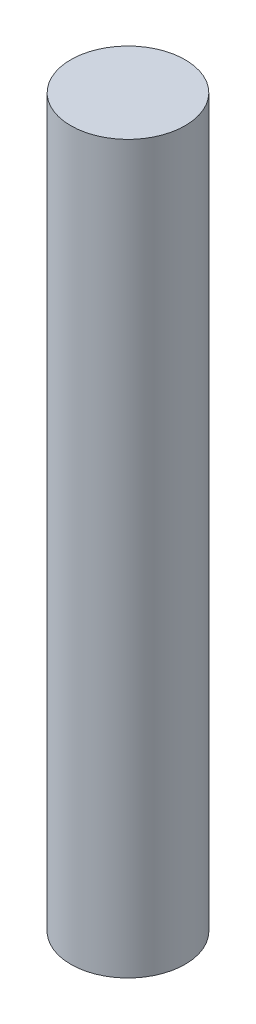
ISO-10303-21;
HEADER;
FILE_DESCRIPTION(('STEP AP214'),'2;1');
FILE_NAME('part.step','',(''),(''),'','','');
FILE_SCHEMA(('AUTOMOTIVE_DESIGN { 1 0 10303 214 1 1 1 1 }'));
ENDSEC;
DATA;
#1=APPLICATION_CONTEXT('core data for automotive mechanical design processes');
#2=APPLICATION_PROTOCOL_DEFINITION('international standard','automotive_design',2000,#1);
#3=PRODUCT_CONTEXT('',#1,'mechanical');
#4=PRODUCT('Part','Part','',(#3));
#5=PRODUCT_RELATED_PRODUCT_CATEGORY('part','',(#4));
#6=PRODUCT_DEFINITION_FORMATION('','',#4);
#7=PRODUCT_DEFINITION_CONTEXT('part definition',#1,'design');
#8=PRODUCT_DEFINITION('design','',#6,#7);
#9=PRODUCT_DEFINITION_SHAPE('','',#8);
#10=(LENGTH_UNIT() NAMED_UNIT(*) SI_UNIT(.MILLI.,.METRE.));
#11=(NAMED_UNIT(*) PLANE_ANGLE_UNIT() SI_UNIT($,.RADIAN.));
#12=(NAMED_UNIT(*) SI_UNIT($,.STERADIAN.) SOLID_ANGLE_UNIT());
#13=UNCERTAINTY_MEASURE_WITH_UNIT(LENGTH_MEASURE(1.E-05),#10,'distance_accuracy_value','');
#14=(GEOMETRIC_REPRESENTATION_CONTEXT(3) GLOBAL_UNCERTAINTY_ASSIGNED_CONTEXT((#13)) GLOBAL_UNIT_ASSIGNED_CONTEXT((#10,
#11,#12)) REPRESENTATION_CONTEXT('',''));
#15=CARTESIAN_POINT('',(0.,0.,0.));
#16=DIRECTION('',(0.,0.,1.));
#17=DIRECTION('',(1.,0.,0.));
#18=AXIS2_PLACEMENT_3D('',#15,#16,#17);
#19=CARTESIAN_POINT('',(0.,50.8,0.));
#20=DIRECTION('',(0.,-1.,0.));
#21=DIRECTION('',(0.,0.,-1.));
#22=AXIS2_PLACEMENT_3D('',#19,#20,#21);
#23=CYLINDRICAL_SURFACE('',#22,4.);
#24=CARTESIAN_POINT('',(0.,50.8,0.));
#25=DIRECTION('',(0.,1.,0.));
#26=DIRECTION('',(0.,0.,1.));
#27=AXIS2_PLACEMENT_3D('',#24,#25,#26);
#28=CIRCLE('',#27,4.);
#29=CARTESIAN_POINT('',(0.,50.8,4.));
#30=VERTEX_POINT('',#29);
#31=EDGE_CURVE('E10',#30,#30,#28,.T.);
#32=ORIENTED_EDGE('',*,*,#31,.F.);
#33=EDGE_LOOP('',(#32));
#34=FACE_BOUND('',#33,.T.);
#35=CARTESIAN_POINT('',(0.,0.,0.));
#36=DIRECTION('',(0.,1.,0.));
#37=DIRECTION('',(0.,0.,1.));
#38=AXIS2_PLACEMENT_3D('',#35,#36,#37);
#39=CIRCLE('',#38,4.);
#40=CARTESIAN_POINT('',(0.,0.,4.));
#41=VERTEX_POINT('',#40);
#42=EDGE_CURVE('E44',#41,#41,#39,.T.);
#43=ORIENTED_EDGE('',*,*,#42,.T.);
#44=EDGE_LOOP('',(#43));
#45=FACE_BOUND('',#44,.T.);
#46=ADVANCED_FACE('F41',(#34,#45),#23,.T.);
#47=CARTESIAN_POINT('',(0.,50.8,0.));
#48=DIRECTION('',(0.,1.,0.));
#49=DIRECTION('',(0.,0.,1.));
#50=AXIS2_PLACEMENT_3D('',#47,#48,#49);
#51=PLANE('',#50);
#52=ORIENTED_EDGE('',*,*,#31,.T.);
#53=EDGE_LOOP('',(#52));
#54=FACE_BOUND('',#53,.T.);
#55=ADVANCED_FACE('F58',(#54),#51,.T.);
#56=CARTESIAN_POINT('',(0.,0.,0.));
#57=DIRECTION('',(0.,1.,0.));
#58=DIRECTION('',(0.,0.,1.));
#59=AXIS2_PLACEMENT_3D('',#56,#57,#58);
#60=PLANE('',#59);
#61=ORIENTED_EDGE('',*,*,#42,.F.);
#62=EDGE_LOOP('',(#61));
#63=FACE_BOUND('',#62,.T.);
#64=ADVANCED_FACE('F56',(#63),#60,.F.);
#65=CLOSED_SHELL('',(#46,#55,#64));
#66=MANIFOLD_SOLID_BREP('B2',#65);
#67=ADVANCED_BREP_SHAPE_REPRESENTATION('',(#18,#66),#14);
#68=SHAPE_DEFINITION_REPRESENTATION(#9,#67);
ENDSEC;
END-ISO-10303-21;
